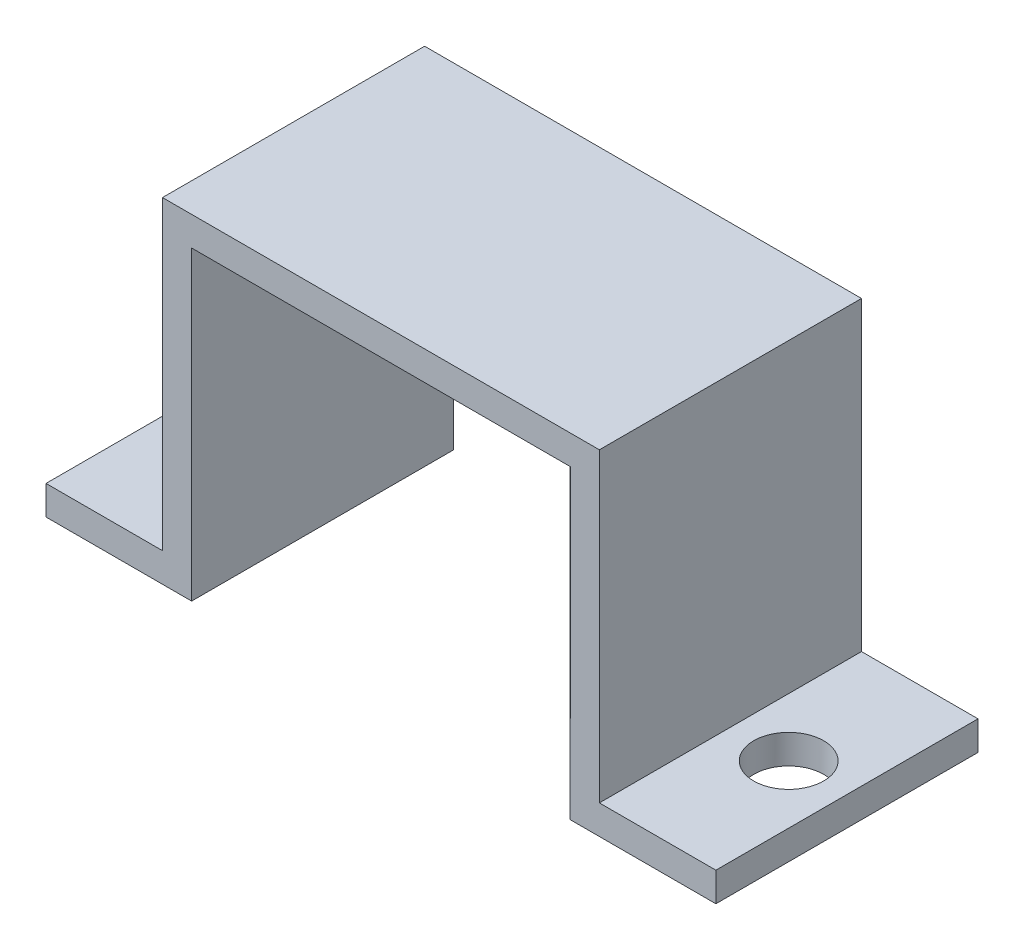
ISO-10303-21;
HEADER;
FILE_DESCRIPTION(('STEP AP214'),'2;1');
FILE_NAME('part.step','',(''),(''),'','','');
FILE_SCHEMA(('AUTOMOTIVE_DESIGN { 1 0 10303 214 1 1 1 1 }'));
ENDSEC;
DATA;
#1=APPLICATION_CONTEXT('core data for automotive mechanical design processes');
#2=APPLICATION_PROTOCOL_DEFINITION('international standard','automotive_design',2000,#1);
#3=PRODUCT_CONTEXT('',#1,'mechanical');
#4=PRODUCT('Part','Part','',(#3));
#5=PRODUCT_RELATED_PRODUCT_CATEGORY('part','',(#4));
#6=PRODUCT_DEFINITION_FORMATION('','',#4);
#7=PRODUCT_DEFINITION_CONTEXT('part definition',#1,'design');
#8=PRODUCT_DEFINITION('design','',#6,#7);
#9=PRODUCT_DEFINITION_SHAPE('','',#8);
#10=(LENGTH_UNIT() NAMED_UNIT(*) SI_UNIT(.MILLI.,.METRE.));
#11=(NAMED_UNIT(*) PLANE_ANGLE_UNIT() SI_UNIT($,.RADIAN.));
#12=(NAMED_UNIT(*) SI_UNIT($,.STERADIAN.) SOLID_ANGLE_UNIT());
#13=UNCERTAINTY_MEASURE_WITH_UNIT(LENGTH_MEASURE(1.E-05),#10,'distance_accuracy_value','');
#14=(GEOMETRIC_REPRESENTATION_CONTEXT(3) GLOBAL_UNCERTAINTY_ASSIGNED_CONTEXT((#13)) GLOBAL_UNIT_ASSIGNED_CONTEXT((#10,
#11,#12)) REPRESENTATION_CONTEXT('',''));
#15=CARTESIAN_POINT('',(0.,0.,0.));
#16=DIRECTION('',(0.,0.,1.));
#17=DIRECTION('',(1.,0.,0.));
#18=AXIS2_PLACEMENT_3D('',#15,#16,#17);
#19=CARTESIAN_POINT('',(7.5,0.,9.));
#20=DIRECTION('',(-1.,0.,0.));
#21=DIRECTION('',(0.,0.,1.));
#22=AXIS2_PLACEMENT_3D('',#19,#20,#21);
#23=PLANE('',#22);
#24=DIRECTION('',(0.,1.,0.));
#25=VECTOR('',#24,1.);
#26=CARTESIAN_POINT('',(7.5,0.,0.));
#27=LINE('',#26,#25);
#28=CARTESIAN_POINT('',(7.5,0.999999999999999,0.));
#29=VERTEX_POINT('',#28);
#30=CARTESIAN_POINT('',(7.5,11.5,0.));
#31=VERTEX_POINT('',#30);
#32=EDGE_CURVE('E166',#29,#31,#27,.T.);
#33=ORIENTED_EDGE('',*,*,#32,.T.);
#34=DIRECTION('',(0.,0.,-1.));
#35=VECTOR('',#34,1.);
#36=CARTESIAN_POINT('',(7.5,11.5,9.));
#37=LINE('',#36,#35);
#38=CARTESIAN_POINT('',(7.5,11.5,9.));
#39=VERTEX_POINT('',#38);
#40=EDGE_CURVE('E11',#39,#31,#37,.T.);
#41=ORIENTED_EDGE('',*,*,#40,.F.);
#42=DIRECTION('',(0.,1.,0.));
#43=VECTOR('',#42,1.);
#44=CARTESIAN_POINT('',(7.5,0.,9.));
#45=LINE('',#44,#43);
#46=CARTESIAN_POINT('',(7.5,0.999999999999999,9.));
#47=VERTEX_POINT('',#46);
#48=EDGE_CURVE('E208',#47,#39,#45,.T.);
#49=ORIENTED_EDGE('',*,*,#48,.F.);
#50=DIRECTION('',(0.,0.,-1.));
#51=VECTOR('',#50,1.);
#52=CARTESIAN_POINT('',(7.5,0.999999999999999,9.));
#53=LINE('',#52,#51);
#54=EDGE_CURVE('E162',#47,#29,#53,.T.);
#55=ORIENTED_EDGE('',*,*,#54,.T.);
#56=EDGE_LOOP('',(#33,#41,#49,#55));
#57=FACE_BOUND('',#56,.T.);
#58=ADVANCED_FACE('F41',(#57),#23,.F.);
#59=CARTESIAN_POINT('',(0.,11.5,9.));
#60=DIRECTION('',(0.,-1.,0.));
#61=DIRECTION('',(0.,0.,-1.));
#62=AXIS2_PLACEMENT_3D('',#59,#60,#61);
#63=PLANE('',#62);
#64=DIRECTION('',(-1.,0.,0.));
#65=VECTOR('',#64,1.);
#66=CARTESIAN_POINT('',(0.,11.5,0.));
#67=LINE('',#66,#65);
#68=CARTESIAN_POINT('',(-7.5,11.5,0.));
#69=VERTEX_POINT('',#68);
#70=EDGE_CURVE('E170',#31,#69,#67,.T.);
#71=ORIENTED_EDGE('',*,*,#70,.T.);
#72=DIRECTION('',(0.,0.,-1.));
#73=VECTOR('',#72,1.);
#74=CARTESIAN_POINT('',(-7.5,11.5,9.));
#75=LINE('',#74,#73);
#76=CARTESIAN_POINT('',(-7.5,11.5,9.));
#77=VERTEX_POINT('',#76);
#78=EDGE_CURVE('E51',#77,#69,#75,.T.);
#79=ORIENTED_EDGE('',*,*,#78,.F.);
#80=DIRECTION('',(-1.,0.,0.));
#81=VECTOR('',#80,1.);
#82=CARTESIAN_POINT('',(0.,11.5,9.));
#83=LINE('',#82,#81);
#84=EDGE_CURVE('E114',#39,#77,#83,.T.);
#85=ORIENTED_EDGE('',*,*,#84,.F.);
#86=ORIENTED_EDGE('',*,*,#40,.T.);
#87=EDGE_LOOP('',(#71,#79,#85,#86));
#88=FACE_BOUND('',#87,.T.);
#89=ADVANCED_FACE('F241',(#88),#63,.F.);
#90=CARTESIAN_POINT('',(-7.5,0.,9.));
#91=DIRECTION('',(-1.,0.,0.));
#92=DIRECTION('',(0.,0.,1.));
#93=AXIS2_PLACEMENT_3D('',#90,#91,#92);
#94=PLANE('',#93);
#95=DIRECTION('',(0.,1.,0.));
#96=VECTOR('',#95,1.);
#97=CARTESIAN_POINT('',(-7.5,0.,0.));
#98=LINE('',#97,#96);
#99=CARTESIAN_POINT('',(-7.5,0.999999999999999,0.));
#100=VERTEX_POINT('',#99);
#101=EDGE_CURVE('E175',#100,#69,#98,.T.);
#102=ORIENTED_EDGE('',*,*,#101,.F.);
#103=DIRECTION('',(0.,0.,-1.));
#104=VECTOR('',#103,1.);
#105=CARTESIAN_POINT('',(-7.5,0.999999999999999,9.));
#106=LINE('',#105,#104);
#107=CARTESIAN_POINT('',(-7.5,0.999999999999999,9.));
#108=VERTEX_POINT('',#107);
#109=EDGE_CURVE('E231',#108,#100,#106,.T.);
#110=ORIENTED_EDGE('',*,*,#109,.F.);
#111=DIRECTION('',(0.,1.,0.));
#112=VECTOR('',#111,1.);
#113=CARTESIAN_POINT('',(-7.5,0.,9.));
#114=LINE('',#113,#112);
#115=EDGE_CURVE('E240',#108,#77,#114,.T.);
#116=ORIENTED_EDGE('',*,*,#115,.T.);
#117=ORIENTED_EDGE('',*,*,#78,.T.);
#118=EDGE_LOOP('',(#102,#110,#116,#117));
#119=FACE_BOUND('',#118,.T.);
#120=ADVANCED_FACE('F238',(#119),#94,.T.);
#121=CARTESIAN_POINT('',(0.,0.999999999999999,9.));
#122=DIRECTION('',(0.,1.,0.));
#123=DIRECTION('',(0.,0.,1.));
#124=AXIS2_PLACEMENT_3D('',#121,#122,#123);
#125=PLANE('',#124);
#126=CARTESIAN_POINT('',(-9.5,0.999999999999999,4.5));
#127=DIRECTION('',(0.,-1.,0.));
#128=DIRECTION('',(0.,0.,1.));
#129=AXIS2_PLACEMENT_3D('',#126,#127,#128);
#130=CIRCLE('',#129,1.2);
#131=CARTESIAN_POINT('',(-9.5,0.999999999999999,5.7));
#132=VERTEX_POINT('',#131);
#133=EDGE_CURVE('E340',#132,#132,#130,.T.);
#134=ORIENTED_EDGE('',*,*,#133,.T.);
#135=EDGE_LOOP('',(#134));
#136=FACE_BOUND('',#135,.T.);
#137=DIRECTION('',(1.,0.,0.));
#138=VECTOR('',#137,1.);
#139=CARTESIAN_POINT('',(0.,0.999999999999999,0.));
#140=LINE('',#139,#138);
#141=CARTESIAN_POINT('',(-11.5,0.999999999999999,0.));
#142=VERTEX_POINT('',#141);
#143=EDGE_CURVE('E179',#142,#100,#140,.T.);
#144=ORIENTED_EDGE('',*,*,#143,.F.);
#145=DIRECTION('',(0.,0.,-1.));
#146=VECTOR('',#145,1.);
#147=CARTESIAN_POINT('',(-11.5,0.999999999999999,9.));
#148=LINE('',#147,#146);
#149=CARTESIAN_POINT('',(-11.5,0.999999999999999,9.));
#150=VERTEX_POINT('',#149);
#151=EDGE_CURVE('E228',#150,#142,#148,.T.);
#152=ORIENTED_EDGE('',*,*,#151,.F.);
#153=DIRECTION('',(1.,0.,0.));
#154=VECTOR('',#153,1.);
#155=CARTESIAN_POINT('',(0.,0.999999999999999,9.));
#156=LINE('',#155,#154);
#157=EDGE_CURVE('E252',#150,#108,#156,.T.);
#158=ORIENTED_EDGE('',*,*,#157,.T.);
#159=ORIENTED_EDGE('',*,*,#109,.T.);
#160=EDGE_LOOP('',(#144,#152,#158,#159));
#161=FACE_BOUND('',#160,.T.);
#162=ADVANCED_FACE('F249',(#136,#161),#125,.T.);
#163=CARTESIAN_POINT('',(-11.5,0.,9.));
#164=DIRECTION('',(-1.,0.,0.));
#165=DIRECTION('',(0.,0.,1.));
#166=AXIS2_PLACEMENT_3D('',#163,#164,#165);
#167=PLANE('',#166);
#168=DIRECTION('',(0.,1.,0.));
#169=VECTOR('',#168,1.);
#170=CARTESIAN_POINT('',(-11.5,0.,0.));
#171=LINE('',#170,#169);
#172=CARTESIAN_POINT('',(-11.5,0.,0.));
#173=VERTEX_POINT('',#172);
#174=EDGE_CURVE('E183',#173,#142,#171,.T.);
#175=ORIENTED_EDGE('',*,*,#174,.F.);
#176=DIRECTION('',(0.,0.,-1.));
#177=VECTOR('',#176,1.);
#178=CARTESIAN_POINT('',(-11.5,0.,9.));
#179=LINE('',#178,#177);
#180=CARTESIAN_POINT('',(-11.5,0.,9.));
#181=VERTEX_POINT('',#180);
#182=EDGE_CURVE('E225',#181,#173,#179,.T.);
#183=ORIENTED_EDGE('',*,*,#182,.F.);
#184=DIRECTION('',(0.,1.,0.));
#185=VECTOR('',#184,1.);
#186=CARTESIAN_POINT('',(-11.5,0.,9.));
#187=LINE('',#186,#185);
#188=EDGE_CURVE('E259',#181,#150,#187,.T.);
#189=ORIENTED_EDGE('',*,*,#188,.T.);
#190=ORIENTED_EDGE('',*,*,#151,.T.);
#191=EDGE_LOOP('',(#175,#183,#189,#190));
#192=FACE_BOUND('',#191,.T.);
#193=ADVANCED_FACE('F306',(#192),#167,.T.);
#194=CARTESIAN_POINT('',(0.,0.,9.));
#195=DIRECTION('',(0.,-1.,0.));
#196=DIRECTION('',(1.,0.,0.));
#197=AXIS2_PLACEMENT_3D('',#194,#195,#196);
#198=PLANE('',#197);
#199=CARTESIAN_POINT('',(-9.5,0.,4.5));
#200=DIRECTION('',(0.,-1.,0.));
#201=DIRECTION('',(1.,0.,0.));
#202=AXIS2_PLACEMENT_3D('',#199,#200,#201);
#203=CIRCLE('',#202,1.2);
#204=CARTESIAN_POINT('',(-8.3,0.,4.5));
#205=VERTEX_POINT('',#204);
#206=EDGE_CURVE('E44',#205,#205,#203,.F.);
#207=ORIENTED_EDGE('',*,*,#206,.T.);
#208=EDGE_LOOP('',(#207));
#209=FACE_BOUND('',#208,.T.);
#210=DIRECTION('',(-1.,0.,0.));
#211=VECTOR('',#210,1.);
#212=CARTESIAN_POINT('',(0.,0.,0.));
#213=LINE('',#212,#211);
#214=CARTESIAN_POINT('',(-6.5,0.,0.));
#215=VERTEX_POINT('',#214);
#216=EDGE_CURVE('E187',#215,#173,#213,.T.);
#217=ORIENTED_EDGE('',*,*,#216,.F.);
#218=DIRECTION('',(0.,0.,-1.));
#219=VECTOR('',#218,1.);
#220=CARTESIAN_POINT('',(-6.5,0.,9.));
#221=LINE('',#220,#219);
#222=CARTESIAN_POINT('',(-6.5,0.,9.));
#223=VERTEX_POINT('',#222);
#224=EDGE_CURVE('E222',#223,#215,#221,.T.);
#225=ORIENTED_EDGE('',*,*,#224,.F.);
#226=DIRECTION('',(-1.,0.,0.));
#227=VECTOR('',#226,1.);
#228=CARTESIAN_POINT('',(0.,0.,9.));
#229=LINE('',#228,#227);
#230=EDGE_CURVE('E266',#223,#181,#229,.T.);
#231=ORIENTED_EDGE('',*,*,#230,.T.);
#232=ORIENTED_EDGE('',*,*,#182,.T.);
#233=EDGE_LOOP('',(#217,#225,#231,#232));
#234=FACE_BOUND('',#233,.T.);
#235=ADVANCED_FACE('F310',(#209,#234),#198,.T.);
#236=CARTESIAN_POINT('',(-6.5,0.,9.));
#237=DIRECTION('',(-1.,0.,0.));
#238=DIRECTION('',(0.,0.,1.));
#239=AXIS2_PLACEMENT_3D('',#236,#237,#238);
#240=PLANE('',#239);
#241=DIRECTION('',(0.,1.,0.));
#242=VECTOR('',#241,1.);
#243=CARTESIAN_POINT('',(-6.5,0.,0.));
#244=LINE('',#243,#242);
#245=CARTESIAN_POINT('',(-6.5,10.5,0.));
#246=VERTEX_POINT('',#245);
#247=EDGE_CURVE('E191',#215,#246,#244,.T.);
#248=ORIENTED_EDGE('',*,*,#247,.T.);
#249=DIRECTION('',(0.,0.,-1.));
#250=VECTOR('',#249,1.);
#251=CARTESIAN_POINT('',(-6.5,10.5,9.));
#252=LINE('',#251,#250);
#253=CARTESIAN_POINT('',(-6.5,10.5,9.));
#254=VERTEX_POINT('',#253);
#255=EDGE_CURVE('E218',#254,#246,#252,.T.);
#256=ORIENTED_EDGE('',*,*,#255,.F.);
#257=DIRECTION('',(0.,1.,0.));
#258=VECTOR('',#257,1.);
#259=CARTESIAN_POINT('',(-6.5,0.,9.));
#260=LINE('',#259,#258);
#261=EDGE_CURVE('E270',#223,#254,#260,.T.);
#262=ORIENTED_EDGE('',*,*,#261,.F.);
#263=ORIENTED_EDGE('',*,*,#224,.T.);
#264=EDGE_LOOP('',(#248,#256,#262,#263));
#265=FACE_BOUND('',#264,.T.);
#266=ADVANCED_FACE('F314',(#265),#240,.F.);
#267=CARTESIAN_POINT('',(0.,10.5,9.));
#268=DIRECTION('',(0.,1.,0.));
#269=DIRECTION('',(0.,0.,1.));
#270=AXIS2_PLACEMENT_3D('',#267,#268,#269);
#271=PLANE('',#270);
#272=DIRECTION('',(1.,0.,0.));
#273=VECTOR('',#272,1.);
#274=CARTESIAN_POINT('',(0.,10.5,0.));
#275=LINE('',#274,#273);
#276=CARTESIAN_POINT('',(6.5,10.5,0.));
#277=VERTEX_POINT('',#276);
#278=EDGE_CURVE('E194',#246,#277,#275,.T.);
#279=ORIENTED_EDGE('',*,*,#278,.T.);
#280=DIRECTION('',(0.,0.,-1.));
#281=VECTOR('',#280,1.);
#282=CARTESIAN_POINT('',(6.5,10.5,9.));
#283=LINE('',#282,#281);
#284=CARTESIAN_POINT('',(6.5,10.5,9.));
#285=VERTEX_POINT('',#284);
#286=EDGE_CURVE('E215',#285,#277,#283,.T.);
#287=ORIENTED_EDGE('',*,*,#286,.F.);
#288=DIRECTION('',(1.,0.,0.));
#289=VECTOR('',#288,1.);
#290=CARTESIAN_POINT('',(0.,10.5,9.));
#291=LINE('',#290,#289);
#292=EDGE_CURVE('E273',#254,#285,#291,.T.);
#293=ORIENTED_EDGE('',*,*,#292,.F.);
#294=ORIENTED_EDGE('',*,*,#255,.T.);
#295=EDGE_LOOP('',(#279,#287,#293,#294));
#296=FACE_BOUND('',#295,.T.);
#297=ADVANCED_FACE('F318',(#296),#271,.F.);
#298=CARTESIAN_POINT('',(6.5,0.,9.));
#299=DIRECTION('',(-1.,0.,0.));
#300=DIRECTION('',(0.,0.,1.));
#301=AXIS2_PLACEMENT_3D('',#298,#299,#300);
#302=PLANE('',#301);
#303=DIRECTION('',(0.,1.,0.));
#304=VECTOR('',#303,1.);
#305=CARTESIAN_POINT('',(6.5,0.,0.));
#306=LINE('',#305,#304);
#307=CARTESIAN_POINT('',(6.5,0.,0.));
#308=VERTEX_POINT('',#307);
#309=EDGE_CURVE('E198',#308,#277,#306,.T.);
#310=ORIENTED_EDGE('',*,*,#309,.F.);
#311=DIRECTION('',(0.,0.,-1.));
#312=VECTOR('',#311,1.);
#313=CARTESIAN_POINT('',(6.5,0.,9.));
#314=LINE('',#313,#312);
#315=CARTESIAN_POINT('',(6.5,0.,9.));
#316=VERTEX_POINT('',#315);
#317=EDGE_CURVE('E155',#316,#308,#314,.T.);
#318=ORIENTED_EDGE('',*,*,#317,.F.);
#319=DIRECTION('',(0.,1.,0.));
#320=VECTOR('',#319,1.);
#321=CARTESIAN_POINT('',(6.5,0.,9.));
#322=LINE('',#321,#320);
#323=EDGE_CURVE('E146',#316,#285,#322,.T.);
#324=ORIENTED_EDGE('',*,*,#323,.T.);
#325=ORIENTED_EDGE('',*,*,#286,.T.);
#326=EDGE_LOOP('',(#310,#318,#324,#325));
#327=FACE_BOUND('',#326,.T.);
#328=ADVANCED_FACE('F278',(#327),#302,.T.);
#329=CARTESIAN_POINT('',(0.,0.,9.));
#330=DIRECTION('',(0.,1.,0.));
#331=DIRECTION('',(-1.,0.,0.));
#332=AXIS2_PLACEMENT_3D('',#329,#330,#331);
#333=PLANE('',#332);
#334=CARTESIAN_POINT('',(9.5,0.,4.5));
#335=DIRECTION('',(0.,1.,0.));
#336=DIRECTION('',(-1.,0.,0.));
#337=AXIS2_PLACEMENT_3D('',#334,#335,#336);
#338=CIRCLE('',#337,1.2);
#339=CARTESIAN_POINT('',(8.3,0.,4.5));
#340=VERTEX_POINT('',#339);
#341=EDGE_CURVE('E171',#340,#340,#338,.T.);
#342=ORIENTED_EDGE('',*,*,#341,.T.);
#343=EDGE_LOOP('',(#342));
#344=FACE_BOUND('',#343,.T.);
#345=DIRECTION('',(1.,0.,0.));
#346=VECTOR('',#345,1.);
#347=CARTESIAN_POINT('',(0.,0.,0.));
#348=LINE('',#347,#346);
#349=CARTESIAN_POINT('',(11.5,0.,0.));
#350=VERTEX_POINT('',#349);
#351=EDGE_CURVE('E153',#308,#350,#348,.T.);
#352=ORIENTED_EDGE('',*,*,#351,.T.);
#353=DIRECTION('',(0.,0.,-1.));
#354=VECTOR('',#353,1.);
#355=CARTESIAN_POINT('',(11.5,0.,9.));
#356=LINE('',#355,#354);
#357=CARTESIAN_POINT('',(11.5,0.,9.));
#358=VERTEX_POINT('',#357);
#359=EDGE_CURVE('E150',#358,#350,#356,.T.);
#360=ORIENTED_EDGE('',*,*,#359,.F.);
#361=DIRECTION('',(1.,0.,0.));
#362=VECTOR('',#361,1.);
#363=CARTESIAN_POINT('',(0.,0.,9.));
#364=LINE('',#363,#362);
#365=EDGE_CURVE('E140',#316,#358,#364,.T.);
#366=ORIENTED_EDGE('',*,*,#365,.F.);
#367=ORIENTED_EDGE('',*,*,#317,.T.);
#368=EDGE_LOOP('',(#352,#360,#366,#367));
#369=FACE_BOUND('',#368,.T.);
#370=ADVANCED_FACE('F151',(#344,#369),#333,.F.);
#371=CARTESIAN_POINT('',(11.5,0.,9.));
#372=DIRECTION('',(-1.,0.,0.));
#373=DIRECTION('',(0.,0.,1.));
#374=AXIS2_PLACEMENT_3D('',#371,#372,#373);
#375=PLANE('',#374);
#376=DIRECTION('',(0.,1.,0.));
#377=VECTOR('',#376,1.);
#378=CARTESIAN_POINT('',(11.5,0.,0.));
#379=LINE('',#378,#377);
#380=CARTESIAN_POINT('',(11.5,0.999999999999999,0.));
#381=VERTEX_POINT('',#380);
#382=EDGE_CURVE('E100',#350,#381,#379,.T.);
#383=ORIENTED_EDGE('',*,*,#382,.T.);
#384=DIRECTION('',(0.,0.,-1.));
#385=VECTOR('',#384,1.);
#386=CARTESIAN_POINT('',(11.5,0.999999999999999,9.));
#387=LINE('',#386,#385);
#388=CARTESIAN_POINT('',(11.5,0.999999999999999,9.));
#389=VERTEX_POINT('',#388);
#390=EDGE_CURVE('E156',#389,#381,#387,.T.);
#391=ORIENTED_EDGE('',*,*,#390,.F.);
#392=DIRECTION('',(0.,1.,0.));
#393=VECTOR('',#392,1.);
#394=CARTESIAN_POINT('',(11.5,0.,9.));
#395=LINE('',#394,#393);
#396=EDGE_CURVE('E144',#358,#389,#395,.T.);
#397=ORIENTED_EDGE('',*,*,#396,.F.);
#398=ORIENTED_EDGE('',*,*,#359,.T.);
#399=EDGE_LOOP('',(#383,#391,#397,#398));
#400=FACE_BOUND('',#399,.T.);
#401=ADVANCED_FACE('F158',(#400),#375,.F.);
#402=CARTESIAN_POINT('',(0.,0.999999999999999,9.));
#403=DIRECTION('',(0.,-1.,0.));
#404=DIRECTION('',(0.,0.,-1.));
#405=AXIS2_PLACEMENT_3D('',#402,#403,#404);
#406=PLANE('',#405);
#407=CARTESIAN_POINT('',(9.5,0.999999999999999,4.5));
#408=DIRECTION('',(0.,1.,0.));
#409=DIRECTION('',(0.,0.,1.));
#410=AXIS2_PLACEMENT_3D('',#407,#408,#409);
#411=CIRCLE('',#410,1.2);
#412=CARTESIAN_POINT('',(9.5,0.999999999999999,5.7));
#413=VERTEX_POINT('',#412);
#414=EDGE_CURVE('E333',#413,#413,#411,.T.);
#415=ORIENTED_EDGE('',*,*,#414,.F.);
#416=EDGE_LOOP('',(#415));
#417=FACE_BOUND('',#416,.T.);
#418=DIRECTION('',(-1.,0.,0.));
#419=VECTOR('',#418,1.);
#420=CARTESIAN_POINT('',(0.,0.999999999999999,0.));
#421=LINE('',#420,#419);
#422=EDGE_CURVE('E106',#381,#29,#421,.T.);
#423=ORIENTED_EDGE('',*,*,#422,.T.);
#424=ORIENTED_EDGE('',*,*,#54,.F.);
#425=DIRECTION('',(-1.,0.,0.));
#426=VECTOR('',#425,1.);
#427=CARTESIAN_POINT('',(0.,0.999999999999999,9.));
#428=LINE('',#427,#426);
#429=EDGE_CURVE('E59',#389,#47,#428,.T.);
#430=ORIENTED_EDGE('',*,*,#429,.F.);
#431=ORIENTED_EDGE('',*,*,#390,.T.);
#432=EDGE_LOOP('',(#423,#424,#430,#431));
#433=FACE_BOUND('',#432,.T.);
#434=ADVANCED_FACE('F283',(#417,#433),#406,.F.);
#435=CARTESIAN_POINT('',(0.,0.,9.));
#436=DIRECTION('',(0.,0.,1.));
#437=DIRECTION('',(1.,0.,0.));
#438=AXIS2_PLACEMENT_3D('',#435,#436,#437);
#439=PLANE('',#438);
#440=ORIENTED_EDGE('',*,*,#48,.T.);
#441=ORIENTED_EDGE('',*,*,#84,.T.);
#442=ORIENTED_EDGE('',*,*,#115,.F.);
#443=ORIENTED_EDGE('',*,*,#157,.F.);
#444=ORIENTED_EDGE('',*,*,#188,.F.);
#445=ORIENTED_EDGE('',*,*,#230,.F.);
#446=ORIENTED_EDGE('',*,*,#261,.T.);
#447=ORIENTED_EDGE('',*,*,#292,.T.);
#448=ORIENTED_EDGE('',*,*,#323,.F.);
#449=ORIENTED_EDGE('',*,*,#365,.T.);
#450=ORIENTED_EDGE('',*,*,#396,.T.);
#451=ORIENTED_EDGE('',*,*,#429,.T.);
#452=EDGE_LOOP('',(#440,#441,#442,#443,#444,#445,#446,#447,#448,#449,#450,#451));
#453=FACE_BOUND('',#452,.T.);
#454=ADVANCED_FACE('F142',(#453),#439,.T.);
#455=CARTESIAN_POINT('',(0.,0.,0.));
#456=DIRECTION('',(0.,0.,1.));
#457=DIRECTION('',(1.,0.,0.));
#458=AXIS2_PLACEMENT_3D('',#455,#456,#457);
#459=PLANE('',#458);
#460=ORIENTED_EDGE('',*,*,#32,.F.);
#461=ORIENTED_EDGE('',*,*,#422,.F.);
#462=ORIENTED_EDGE('',*,*,#382,.F.);
#463=ORIENTED_EDGE('',*,*,#351,.F.);
#464=ORIENTED_EDGE('',*,*,#309,.T.);
#465=ORIENTED_EDGE('',*,*,#278,.F.);
#466=ORIENTED_EDGE('',*,*,#247,.F.);
#467=ORIENTED_EDGE('',*,*,#216,.T.);
#468=ORIENTED_EDGE('',*,*,#174,.T.);
#469=ORIENTED_EDGE('',*,*,#143,.T.);
#470=ORIENTED_EDGE('',*,*,#101,.T.);
#471=ORIENTED_EDGE('',*,*,#70,.F.);
#472=EDGE_LOOP('',(#460,#461,#462,#463,#464,#465,#466,#467,#468,#469,#470,#471));
#473=FACE_BOUND('',#472,.T.);
#474=ADVANCED_FACE('F245',(#473),#459,.F.);
#475=CARTESIAN_POINT('',(9.5,-28.,4.5));
#476=DIRECTION('',(0.,1.,0.));
#477=DIRECTION('',(0.,0.,1.));
#478=AXIS2_PLACEMENT_3D('',#475,#476,#477);
#479=CYLINDRICAL_SURFACE('',#478,1.2);
#480=ORIENTED_EDGE('',*,*,#414,.T.);
#481=EDGE_LOOP('',(#480));
#482=FACE_BOUND('',#481,.T.);
#483=ORIENTED_EDGE('',*,*,#341,.F.);
#484=EDGE_LOOP('',(#483));
#485=FACE_BOUND('',#484,.T.);
#486=ADVANCED_FACE('F352',(#482,#485),#479,.F.);
#487=CARTESIAN_POINT('',(-9.5,-28.,4.5));
#488=DIRECTION('',(0.,1.,0.));
#489=DIRECTION('',(0.,0.,1.));
#490=AXIS2_PLACEMENT_3D('',#487,#488,#489);
#491=CYLINDRICAL_SURFACE('',#490,1.2);
#492=ORIENTED_EDGE('',*,*,#206,.F.);
#493=EDGE_LOOP('',(#492));
#494=FACE_BOUND('',#493,.T.);
#495=ORIENTED_EDGE('',*,*,#133,.F.);
#496=EDGE_LOOP('',(#495));
#497=FACE_BOUND('',#496,.T.);
#498=ADVANCED_FACE('F349',(#494,#497),#491,.F.);
#499=CLOSED_SHELL('',(#58,#89,#120,#162,#193,#235,#266,#297,#328,#370,#401,#434,#454,#474,#486,#498));
#500=MANIFOLD_SOLID_BREP('B2',#499);
#501=ADVANCED_BREP_SHAPE_REPRESENTATION('',(#18,#500),#14);
#502=SHAPE_DEFINITION_REPRESENTATION(#9,#501);
ENDSEC;
END-ISO-10303-21;
